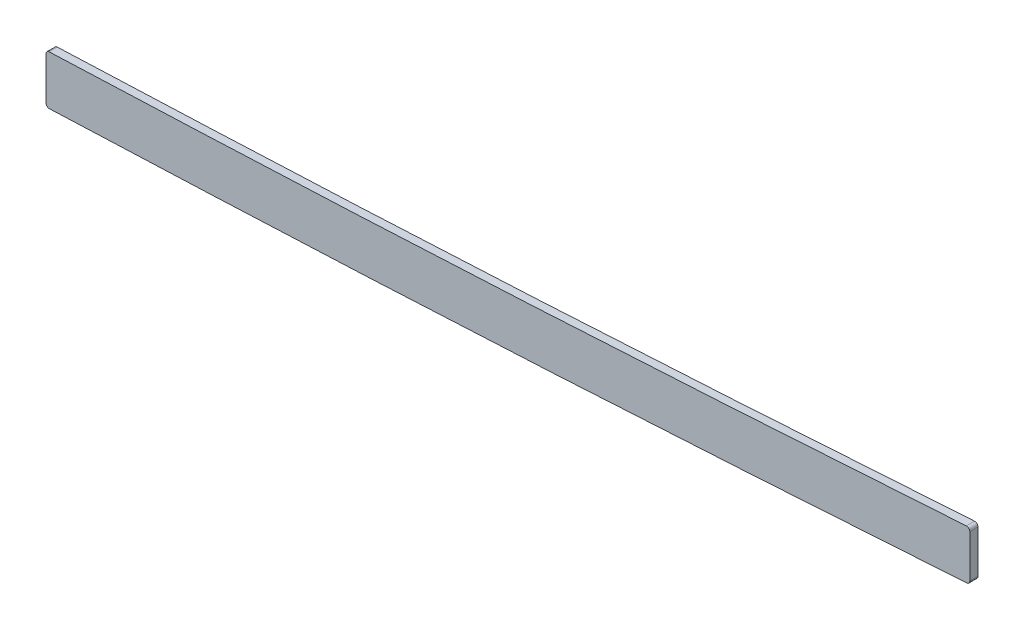
ISO-10303-21;
HEADER;
FILE_DESCRIPTION(('STEP AP214'),'2;1');
FILE_NAME('part.step','',(''),(''),'','','');
FILE_SCHEMA(('AUTOMOTIVE_DESIGN { 1 0 10303 214 1 1 1 1 }'));
ENDSEC;
DATA;
#1=APPLICATION_CONTEXT('core data for automotive mechanical design processes');
#2=APPLICATION_PROTOCOL_DEFINITION('international standard','automotive_design',2000,#1);
#3=PRODUCT_CONTEXT('',#1,'mechanical');
#4=PRODUCT('Part','Part','',(#3));
#5=PRODUCT_RELATED_PRODUCT_CATEGORY('part','',(#4));
#6=PRODUCT_DEFINITION_FORMATION('','',#4);
#7=PRODUCT_DEFINITION_CONTEXT('part definition',#1,'design');
#8=PRODUCT_DEFINITION('design','',#6,#7);
#9=PRODUCT_DEFINITION_SHAPE('','',#8);
#10=(LENGTH_UNIT() NAMED_UNIT(*) SI_UNIT(.MILLI.,.METRE.));
#11=(NAMED_UNIT(*) PLANE_ANGLE_UNIT() SI_UNIT($,.RADIAN.));
#12=(NAMED_UNIT(*) SI_UNIT($,.STERADIAN.) SOLID_ANGLE_UNIT());
#13=UNCERTAINTY_MEASURE_WITH_UNIT(LENGTH_MEASURE(1.E-05),#10,'distance_accuracy_value','');
#14=(GEOMETRIC_REPRESENTATION_CONTEXT(3) GLOBAL_UNCERTAINTY_ASSIGNED_CONTEXT((#13)) GLOBAL_UNIT_ASSIGNED_CONTEXT((#10,
#11,#12)) REPRESENTATION_CONTEXT('',''));
#15=CARTESIAN_POINT('',(0.,0.,0.));
#16=DIRECTION('',(0.,0.,1.));
#17=DIRECTION('',(1.,0.,0.));
#18=AXIS2_PLACEMENT_3D('',#15,#16,#17);
#19=CARTESIAN_POINT('',(2669.54,6.20943054630084E-11,1.5875));
#20=DIRECTION('',(1.,0.,0.));
#21=DIRECTION('',(0.,1.,0.));
#22=AXIS2_PLACEMENT_3D('',#19,#20,#21);
#23=PLANE('',#22);
#24=DIRECTION('',(0.,-1.,0.));
#25=VECTOR('',#24,1.);
#26=CARTESIAN_POINT('',(2669.54,6.20943054630084E-11,-1.5875));
#27=LINE('',#26,#25);
#28=CARTESIAN_POINT('',(2669.54,8.16576508272443,-1.5875));
#29=VERTEX_POINT('',#28);
#30=CARTESIAN_POINT('',(2669.54,-8.38067282995173,-1.5875));
#31=VERTEX_POINT('',#30);
#32=EDGE_CURVE('E144',#29,#31,#27,.T.);
#33=ORIENTED_EDGE('',*,*,#32,.F.);
#34=DIRECTION('',(0.,0.,1.));
#35=VECTOR('',#34,1.);
#36=CARTESIAN_POINT('',(2669.54,8.16576508272443,1.5875));
#37=LINE('',#36,#35);
#38=CARTESIAN_POINT('',(2669.54,8.16576508272443,1.5875));
#39=VERTEX_POINT('',#38);
#40=EDGE_CURVE('E118',#29,#39,#37,.T.);
#41=ORIENTED_EDGE('',*,*,#40,.T.);
#42=DIRECTION('',(0.,-1.,0.));
#43=VECTOR('',#42,1.);
#44=CARTESIAN_POINT('',(2669.54,6.20943054630084E-11,1.5875));
#45=LINE('',#44,#43);
#46=CARTESIAN_POINT('',(2669.54,-8.38067282995173,1.5875));
#47=VERTEX_POINT('',#46);
#48=EDGE_CURVE('E223',#39,#47,#45,.T.);
#49=ORIENTED_EDGE('',*,*,#48,.T.);
#50=DIRECTION('',(0.,0.,-1.));
#51=VECTOR('',#50,1.);
#52=CARTESIAN_POINT('',(2669.54,-8.38067282995173,1.5875));
#53=LINE('',#52,#51);
#54=EDGE_CURVE('E124',#47,#31,#53,.T.);
#55=ORIENTED_EDGE('',*,*,#54,.T.);
#56=EDGE_LOOP('',(#33,#41,#49,#55));
#57=FACE_BOUND('',#56,.T.);
#58=ADVANCED_FACE('F45',(#57),#23,.T.);
#59=CARTESIAN_POINT('',(2698.48667469404,11.4806601503293,1.5875));
#60=CARTESIAN_POINT('',(2691.24737670604,10.9833200828121,1.5875));
#61=CARTESIAN_POINT('',(2679.19516047804,10.1655376868452,1.5875));
#62=CARTESIAN_POINT('',(2662.27652557768,9.03876140898899,1.5875));
#63=CARTESIAN_POINT('',(2635.66628230206,7.2924691456857,1.5875));
#64=CARTESIAN_POINT('',(2596.85766552893,4.8260568530791,1.5875));
#65=CARTESIAN_POINT('',(2545.72974303923,1.75834409257586,1.5875));
#66=CARTESIAN_POINT('',(2494.40530570724,-1.09855523520035,1.5875));
#67=CARTESIAN_POINT('',(2451.53302226734,-3.26657329681936,1.5875));
#68=CARTESIAN_POINT('',(2417.1983167563,-4.86708361008882,1.5875));
#69=CARTESIAN_POINT('',(2391.45707691927,-6.00358923536048,1.5875));
#70=CARTESIAN_POINT('',(2365.63473630713,-7.08685458139135,1.5875));
#71=CARTESIAN_POINT('',(2341.01564201859,-8.07854239792197,1.5875));
#72=CARTESIAN_POINT('',(2320.75075371474,-8.87838665592377,1.5875));
#73=CARTESIAN_POINT('',(2303.44750893366,-9.5580697754435,1.5875));
#74=CARTESIAN_POINT('',(2284.76007664293,-10.2922011195427,1.5875));
#75=CARTESIAN_POINT('',(2261.7633474368,-11.2010322967668,1.5875));
#76=CARTESIAN_POINT('',(2227.28532971514,-12.5838425566113,1.5875));
#77=CARTESIAN_POINT('',(2184.17556939327,-14.3660723604172,1.5875));
#78=CARTESIAN_POINT('',(2132.42906611447,-16.6074278682384,1.5875));
#79=CARTESIAN_POINT('',(2063.42552339989,-19.708920484548,1.5875));
#80=CARTESIAN_POINT('',(1977.17490763451,-23.7005433130483,1.5875));
#81=CARTESIAN_POINT('',(1873.73245143151,-28.149389220677,1.5875));
#82=CARTESIAN_POINT('',(1770.37461881016,-31.6574686487852,1.5875));
#83=CARTESIAN_POINT('',(1667.08568781321,-33.7931175563218,1.5875));
#84=CARTESIAN_POINT('',(1581.01109449057,-34.3831888311612,1.5875));
#85=CARTESIAN_POINT('',(1512.07397125959,-34.4278026003723,1.5875));
#86=CARTESIAN_POINT('',(1443.06151347714,-34.4095104024296,1.5875));
#87=CARTESIAN_POINT('',(1356.80092787913,-34.4244328117572,1.5875));
#88=CARTESIAN_POINT('',(1218.79462695393,-34.4184647879491,1.5875));
#89=CARTESIAN_POINT('',(1115.28902278569,-34.4207027968771,1.5875));
#90=CARTESIAN_POINT('',(1046.28548189005,-34.4207027968771,1.5875));
#91=B_SPLINE_CURVE_WITH_KNOTS('',3,(#59,#60,#61,#62,#63,#64,#65,#66,#67,#68,#69,#70,#71,#72,#73,
#74,#75,#76,#77,#78,#79,#80,#81,#82,#83,#84,#85,#86,#87,#88,#89,#90),.UNSPECIFIED.,.F.,.F.,(4,1,
1,1,1,1,1,1,1,1,1,1,1,1,1,1,1,1,1,1,1,1,1,1,1,1,1,1,1,4),(100.654804519159,102.842388131745,
104.300777206802,105.766098402935,110.877392286712,115.988686170488,121.099980054264,
126.21127393804,128.766920879929,131.322567821817,133.878214763705,136.433861705593,
138.557690156206,139.83551362715,141.545155589369,144.100802531257,146.656449473146,
151.767743356922,156.879037240698,161.990331124474,172.212918892027,182.43550665958,
192.658094427132,202.880682194685,213.103269962237,218.214563846014,223.32585772979,
233.548445497342,243.771033264895,264.2162088),.UNSPECIFIED.);
#92=DIRECTION('',(0.,0.,-1.));
#93=VECTOR('',#92,1.);
#94=SURFACE_OF_LINEAR_EXTRUSION('',#91,#93);
#95=CARTESIAN_POINT('',(2668.1857171688,9.4329653054066,1.5875));
#96=VERTEX_POINT('',#95);
#97=CARTESIAN_POINT('',(2312.62011977482,-9.19769933440686,1.5875));
#98=VERTEX_POINT('',#97);
#99=EDGE_CURVE('E134',#96,#98,#91,.T.);
#100=ORIENTED_EDGE('',*,*,#99,.F.);
#101=DIRECTION('',(0.,0.,-1.));
#102=VECTOR('',#101,1.);
#103=CARTESIAN_POINT('',(2668.18571716881,9.43296530540671,1.5875));
#104=LINE('',#103,#102);
#105=CARTESIAN_POINT('',(2668.18571716881,9.43296530540666,-1.5875));
#106=VERTEX_POINT('',#105);
#107=EDGE_CURVE('E117',#96,#106,#104,.T.);
#108=ORIENTED_EDGE('',*,*,#107,.T.);
#109=CARTESIAN_POINT('',(2698.48667469404,11.4806601503293,-1.5875));
#110=CARTESIAN_POINT('',(2691.24737670604,10.9833200828121,-1.5875));
#111=CARTESIAN_POINT('',(2679.19516047804,10.1655376868452,-1.5875));
#112=CARTESIAN_POINT('',(2662.27652557768,9.03876140898899,-1.5875));
#113=CARTESIAN_POINT('',(2635.66628230206,7.2924691456857,-1.5875));
#114=CARTESIAN_POINT('',(2596.85766552893,4.8260568530791,-1.5875));
#115=CARTESIAN_POINT('',(2545.72974303923,1.75834409257586,-1.5875));
#116=CARTESIAN_POINT('',(2494.40530570724,-1.09855523520035,-1.5875));
#117=CARTESIAN_POINT('',(2451.53302226734,-3.26657329681936,-1.5875));
#118=CARTESIAN_POINT('',(2417.1983167563,-4.86708361008882,-1.5875));
#119=CARTESIAN_POINT('',(2391.45707691927,-6.00358923536048,-1.5875));
#120=CARTESIAN_POINT('',(2365.63473630713,-7.08685458139135,-1.5875));
#121=CARTESIAN_POINT('',(2341.01564201859,-8.07854239792197,-1.5875));
#122=CARTESIAN_POINT('',(2320.75075371474,-8.87838665592377,-1.5875));
#123=CARTESIAN_POINT('',(2303.44750893366,-9.5580697754435,-1.5875));
#124=CARTESIAN_POINT('',(2284.76007664293,-10.2922011195427,-1.5875));
#125=CARTESIAN_POINT('',(2261.7633474368,-11.2010322967668,-1.5875));
#126=CARTESIAN_POINT('',(2227.28532971514,-12.5838425566113,-1.5875));
#127=CARTESIAN_POINT('',(2184.17556939327,-14.3660723604172,-1.5875));
#128=CARTESIAN_POINT('',(2132.42906611447,-16.6074278682384,-1.5875));
#129=CARTESIAN_POINT('',(2063.42552339989,-19.708920484548,-1.5875));
#130=CARTESIAN_POINT('',(1977.17490763451,-23.7005433130483,-1.5875));
#131=CARTESIAN_POINT('',(1873.73245143151,-28.149389220677,-1.5875));
#132=CARTESIAN_POINT('',(1770.37461881016,-31.6574686487852,-1.5875));
#133=CARTESIAN_POINT('',(1667.08568781321,-33.7931175563218,-1.5875));
#134=CARTESIAN_POINT('',(1581.01109449057,-34.3831888311612,-1.5875));
#135=CARTESIAN_POINT('',(1512.07397125959,-34.4278026003723,-1.5875));
#136=CARTESIAN_POINT('',(1443.06151347714,-34.4095104024296,-1.5875));
#137=CARTESIAN_POINT('',(1356.80092787913,-34.4244328117572,-1.5875));
#138=CARTESIAN_POINT('',(1218.79462695393,-34.4184647879491,-1.5875));
#139=CARTESIAN_POINT('',(1115.28902278569,-34.4207027968771,-1.5875));
#140=CARTESIAN_POINT('',(1046.28548189005,-34.4207027968771,-1.5875));
#141=B_SPLINE_CURVE_WITH_KNOTS('',3,(#109,#110,#111,#112,#113,#114,#115,#116,#117,#118,#119,
#120,#121,#122,#123,#124,#125,#126,#127,#128,#129,#130,#131,#132,#133,#134,#135,#136,#137,#138,
#139,#140),.UNSPECIFIED.,.F.,.F.,(4,1,1,1,1,1,1,1,1,1,1,1,1,1,1,1,1,1,1,1,1,1,1,1,1,1,1,1,1,4),
(100.654804519159,102.842388131745,104.300777206802,105.766098402935,110.877392286712,
115.988686170488,121.099980054264,126.21127393804,128.766920879929,131.322567821817,
133.878214763705,136.433861705593,138.557690156206,139.83551362715,141.545155589369,
144.100802531257,146.656449473146,151.767743356922,156.879037240698,161.990331124474,
172.212918892027,182.43550665958,192.658094427132,202.880682194685,213.103269962237,
218.214563846014,223.32585772979,233.548445497342,243.771033264895,264.2162088),.UNSPECIFIED.);
#142=CARTESIAN_POINT('',(2312.62011977482,-9.19769933440686,-1.5875));
#143=VERTEX_POINT('',#142);
#144=EDGE_CURVE('E131',#106,#143,#141,.T.);
#145=ORIENTED_EDGE('',*,*,#144,.T.);
#146=DIRECTION('',(0.,0.,-1.));
#147=VECTOR('',#146,1.);
#148=CARTESIAN_POINT('',(2312.62011977482,-9.19769933440686,-1.5875));
#149=LINE('',#148,#147);
#150=EDGE_CURVE('E137',#143,#98,#149,.F.);
#151=ORIENTED_EDGE('',*,*,#150,.T.);
#152=EDGE_LOOP('',(#100,#108,#145,#151));
#153=FACE_BOUND('',#152,.T.);
#154=ADVANCED_FACE('F130',(#153),#94,.F.);
#155=CARTESIAN_POINT('',(2311.4,5.38412677974243E-11,1.5875));
#156=DIRECTION('',(1.,0.,0.));
#157=DIRECTION('',(0.,1.,0.));
#158=AXIS2_PLACEMENT_3D('',#155,#156,#157);
#159=PLANE('',#158);
#160=DIRECTION('',(0.,-1.,0.));
#161=VECTOR('',#160,1.);
#162=CARTESIAN_POINT('',(2311.4,5.38412677974243E-11,1.5875));
#163=LINE('',#162,#161);
#164=CARTESIAN_POINT('',(2311.4,-10.4667194142858,1.5875));
#165=VERTEX_POINT('',#164);
#166=CARTESIAN_POINT('',(2311.4,-26.989466917101,1.5875));
#167=VERTEX_POINT('',#166);
#168=EDGE_CURVE('E215',#165,#167,#163,.T.);
#169=ORIENTED_EDGE('',*,*,#168,.F.);
#170=DIRECTION('',(0.,0.,-1.));
#171=VECTOR('',#170,1.);
#172=CARTESIAN_POINT('',(2311.4,-10.4667194142858,1.5875));
#173=LINE('',#172,#171);
#174=CARTESIAN_POINT('',(2311.4,-10.4667194142858,-1.5875));
#175=VERTEX_POINT('',#174);
#176=EDGE_CURVE('E11',#165,#175,#173,.T.);
#177=ORIENTED_EDGE('',*,*,#176,.T.);
#178=DIRECTION('',(0.,-1.,0.));
#179=VECTOR('',#178,1.);
#180=CARTESIAN_POINT('',(2311.4,5.38412677974243E-11,-1.5875));
#181=LINE('',#180,#179);
#182=CARTESIAN_POINT('',(2311.4,-26.989466917101,-1.5875));
#183=VERTEX_POINT('',#182);
#184=EDGE_CURVE('E143',#175,#183,#181,.T.);
#185=ORIENTED_EDGE('',*,*,#184,.T.);
#186=DIRECTION('',(0.,0.,1.));
#187=VECTOR('',#186,1.);
#188=CARTESIAN_POINT('',(2311.4,-26.989466917101,1.5875));
#189=LINE('',#188,#187);
#190=EDGE_CURVE('E54',#183,#167,#189,.T.);
#191=ORIENTED_EDGE('',*,*,#190,.T.);
#192=EDGE_LOOP('',(#169,#177,#185,#191));
#193=FACE_BOUND('',#192,.T.);
#194=ADVANCED_FACE('F184',(#193),#159,.F.);
#195=CARTESIAN_POINT('',(2699.79233294449,-7.52454325644929,1.5875));
#196=CARTESIAN_POINT('',(2639.63682069028,-11.6572294058032,1.5875));
#197=CARTESIAN_POINT('',(2579.48130742255,-15.435846921513,1.5875));
#198=CARTESIAN_POINT('',(2518.49810546626,-19.1485286488731,1.5875));
#199=CARTESIAN_POINT('',(2436.3555443117,-23.2523639114786,1.5875));
#200=CARTESIAN_POINT('',(2354.21298315715,-26.6314864233564,1.5875));
#201=CARTESIAN_POINT('',(2332.5703304682,-27.4809881692809,1.5875));
#202=CARTESIAN_POINT('',(2156.26863942885,-34.3777685431634,1.5875));
#203=CARTESIAN_POINT('',(1979.96694737597,-41.6286312484567,1.5875));
#204=CARTESIAN_POINT('',(1824.11427763497,-52.7712658766203,1.5875));
#205=CARTESIAN_POINT('',(1636.92860677809,-53.5795698486924,1.5875));
#206=CARTESIAN_POINT('',(1449.7429359212,-53.4540246131279,1.5875));
#207=CARTESIAN_POINT('',(1418.00673093479,-53.4707027968771,1.5875));
#208=CARTESIAN_POINT('',(1324.89933614602,-53.4707027968771,1.5875));
#209=CARTESIAN_POINT('',(1231.79194034372,-53.4707027968771,1.5875));
#210=CARTESIAN_POINT('',(1170.4412693194,-53.4707027968771,1.5875));
#211=CARTESIAN_POINT('',(1108.78407581299,-53.4707027968771,1.5875));
#212=CARTESIAN_POINT('',(1047.12688234629,-53.4707027968771,1.5875));
#213=CARTESIAN_POINT('',(1046.84641418849,-53.4707027968771,1.5875));
#214=CARTESIAN_POINT('',(1046.56594718406,-53.4707027968771,1.5875));
#215=CARTESIAN_POINT('',(1046.28548189005,-53.4707027968771,1.5875));
#216=(BOUNDED_CURVE() B_SPLINE_CURVE(5,(#195,#196,#197,#198,#199,#200,#201,#202,#203,#204,#205,
#206,#207,#208,#209,#210,#211,#212,#213,#214,#215),.UNSPECIFIED.,.F.,
.F.) B_SPLINE_CURVE_WITH_KNOTS((6,3,3,3,3,3,6),(100.654804519159,130.927896619159,
141.337054719159,218.101815019159,233.772059419159,264.077723219159,264.2162088),
.UNSPECIFIED.) CURVE() GEOMETRIC_REPRESENTATION_ITEM() RATIONAL_B_SPLINE_CURVE((1.,1.,1.,1.,1.,
1.,1.,1.,1.,1.,1.,1.,1.,1.,1.,1.,1.,1.,1.,1.,1.)) REPRESENTATION_ITEM(''));
#217=DIRECTION('',(0.,0.,-1.));
#218=VECTOR('',#217,1.);
#219=SURFACE_OF_LINEAR_EXTRUSION('',#216,#218);
#220=CARTESIAN_POINT('',(2312.71987514369,-28.2584871967033,-1.5875));
#221=CARTESIAN_POINT('',(2329.40547783021,-27.6027081900987,-1.5875));
#222=CARTESIAN_POINT('',(2346.19503632831,-26.9408313965916,-1.5875));
#223=CARTESIAN_POINT('',(2363.08398911934,-26.2644441857733,-1.5875));
#224=CARTESIAN_POINT('',(2434.40380877238,-23.2965631449422,-1.5875));
#225=CARTESIAN_POINT('',(2505.72362842541,-19.7823585871208,-1.5875));
#226=CARTESIAN_POINT('',(2560.35960699296,-16.5784214349998,-1.5875));
#227=CARTESIAN_POINT('',(2614.44199917946,-13.229682637772,-1.5875));
#228=CARTESIAN_POINT('',(2668.35419031106,-9.64787920285397,-1.5875));
#229=(BOUNDED_CURVE() B_SPLINE_CURVE(5,(#220,#221,#222,#223,#224,#225,#226,#227,#228),
.UNSPECIFIED.,.F.,.F.) B_SPLINE_CURVE_WITH_KNOTS((6,3,6),(103.818173568317,112.030586893093,
139.140309943934),
.UNSPECIFIED.) CURVE() GEOMETRIC_REPRESENTATION_ITEM() RATIONAL_B_SPLINE_CURVE((1.,1.,1.,1.,1.,
1.,1.,1.,1.)) REPRESENTATION_ITEM(''));
#230=CARTESIAN_POINT('',(2668.35419046547,-9.64788152706516,-1.5875));
#231=VERTEX_POINT('',#230);
#232=CARTESIAN_POINT('',(2312.71987502721,-28.2584842330797,-1.5875));
#233=VERTEX_POINT('',#232);
#234=EDGE_CURVE('E150',#231,#233,#229,.F.);
#235=ORIENTED_EDGE('',*,*,#234,.F.);
#236=DIRECTION('',(0.,0.,-1.));
#237=VECTOR('',#236,1.);
#238=CARTESIAN_POINT('',(2668.35419031102,-9.64787920285633,-1.5875));
#239=LINE('',#238,#237);
#240=CARTESIAN_POINT('',(2668.35419046551,-9.64788152744234,1.5875));
#241=VERTEX_POINT('',#240);
#242=EDGE_CURVE('E68',#231,#241,#239,.F.);
#243=ORIENTED_EDGE('',*,*,#242,.T.);
#244=CARTESIAN_POINT('',(2668.35419031106,-9.64787920285402,1.5875));
#245=CARTESIAN_POINT('',(2614.44199917946,-13.229682637772,1.5875));
#246=CARTESIAN_POINT('',(2560.35960699296,-16.5784214349999,1.5875));
#247=CARTESIAN_POINT('',(2505.72362842541,-19.7823585871209,1.5875));
#248=CARTESIAN_POINT('',(2434.40380877238,-23.2965631449419,1.5875));
#249=CARTESIAN_POINT('',(2363.08398911935,-26.2644441857729,1.5875));
#250=CARTESIAN_POINT('',(2346.19503632833,-26.9408313965909,1.5875));
#251=CARTESIAN_POINT('',(2329.40547783023,-27.6027081900979,1.5875));
#252=CARTESIAN_POINT('',(2312.71987514372,-28.2584871967023,1.5875));
#253=(BOUNDED_CURVE() B_SPLINE_CURVE(5,(#244,#245,#246,#247,#248,#249,#250,#251,#252),
.UNSPECIFIED.,.F.,.F.) B_SPLINE_CURVE_WITH_KNOTS((6,3,6),(103.818173568318,130.927896619159,
139.140309943932),
.UNSPECIFIED.) CURVE() GEOMETRIC_REPRESENTATION_ITEM() RATIONAL_B_SPLINE_CURVE((1.,1.,1.,1.,1.,
1.,1.,1.,1.)) REPRESENTATION_ITEM(''));
#254=CARTESIAN_POINT('',(2312.7198750272,-28.2584842327322,1.5875));
#255=VERTEX_POINT('',#254);
#256=EDGE_CURVE('E212',#241,#255,#253,.T.);
#257=ORIENTED_EDGE('',*,*,#256,.T.);
#258=DIRECTION('',(0.,0.,-1.));
#259=VECTOR('',#258,1.);
#260=CARTESIAN_POINT('',(2312.71987514529,-28.2584871966404,1.5875));
#261=LINE('',#260,#259);
#262=EDGE_CURVE('E258',#255,#233,#261,.T.);
#263=ORIENTED_EDGE('',*,*,#262,.T.);
#264=EDGE_LOOP('',(#235,#243,#257,#263));
#265=FACE_BOUND('',#264,.T.);
#266=ADVANCED_FACE('F173',(#265),#219,.T.);
#267=CARTESIAN_POINT('',(0.,0.,1.5875));
#268=DIRECTION('',(0.,0.,1.));
#269=DIRECTION('',(1.,0.,0.));
#270=AXIS2_PLACEMENT_3D('',#267,#268,#269);
#271=PLANE('',#270);
#272=ORIENTED_EDGE('',*,*,#48,.F.);
#273=CARTESIAN_POINT('',(2668.27,8.1657650827244,1.5875));
#274=DIRECTION('',(0.,0.,1.));
#275=DIRECTION('',(1.,0.,0.));
#276=AXIS2_PLACEMENT_3D('',#273,#274,#275);
#277=CIRCLE('',#276,1.27);
#278=EDGE_CURVE('E253',#39,#96,#277,.T.);
#279=ORIENTED_EDGE('',*,*,#278,.T.);
#280=ORIENTED_EDGE('',*,*,#99,.T.);
#281=CARTESIAN_POINT('',(2312.67,-10.4667194142858,1.5875));
#282=DIRECTION('',(0.,0.,1.));
#283=DIRECTION('',(1.,0.,0.));
#284=AXIS2_PLACEMENT_3D('',#281,#282,#283);
#285=CIRCLE('',#284,1.27);
#286=EDGE_CURVE('E242',#98,#165,#285,.T.);
#287=ORIENTED_EDGE('',*,*,#286,.T.);
#288=ORIENTED_EDGE('',*,*,#168,.T.);
#289=CARTESIAN_POINT('',(2312.67,-26.989466917101,1.5875));
#290=DIRECTION('',(0.,0.,1.));
#291=DIRECTION('',(1.,0.,0.));
#292=AXIS2_PLACEMENT_3D('',#289,#290,#291);
#293=CIRCLE('',#292,1.27);
#294=EDGE_CURVE('E61',#167,#255,#293,.T.);
#295=ORIENTED_EDGE('',*,*,#294,.T.);
#296=ORIENTED_EDGE('',*,*,#256,.F.);
#297=CARTESIAN_POINT('',(2668.27,-8.38067282995176,1.5875));
#298=DIRECTION('',(0.,0.,1.));
#299=DIRECTION('',(1.,0.,0.));
#300=AXIS2_PLACEMENT_3D('',#297,#298,#299);
#301=CIRCLE('',#300,1.27);
#302=EDGE_CURVE('E246',#241,#47,#301,.T.);
#303=ORIENTED_EDGE('',*,*,#302,.T.);
#304=EDGE_LOOP('',(#272,#279,#280,#287,#288,#295,#296,#303));
#305=FACE_BOUND('',#304,.T.);
#306=ADVANCED_FACE('F183',(#305),#271,.T.);
#307=CARTESIAN_POINT('',(0.,0.,-1.5875));
#308=DIRECTION('',(0.,0.,1.));
#309=DIRECTION('',(1.,0.,0.));
#310=AXIS2_PLACEMENT_3D('',#307,#308,#309);
#311=PLANE('',#310);
#312=ORIENTED_EDGE('',*,*,#144,.F.);
#313=CARTESIAN_POINT('',(2668.27,8.1657650827244,-1.5875));
#314=DIRECTION('',(0.,0.,1.));
#315=DIRECTION('',(1.,0.,0.));
#316=AXIS2_PLACEMENT_3D('',#313,#314,#315);
#317=CIRCLE('',#316,1.27);
#318=EDGE_CURVE('E113',#106,#29,#317,.F.);
#319=ORIENTED_EDGE('',*,*,#318,.T.);
#320=ORIENTED_EDGE('',*,*,#32,.T.);
#321=CARTESIAN_POINT('',(2668.27,-8.38067282995176,-1.5875));
#322=DIRECTION('',(0.,0.,1.));
#323=DIRECTION('',(1.,0.,0.));
#324=AXIS2_PLACEMENT_3D('',#321,#322,#323);
#325=CIRCLE('',#324,1.27);
#326=EDGE_CURVE('E125',#31,#231,#325,.F.);
#327=ORIENTED_EDGE('',*,*,#326,.T.);
#328=ORIENTED_EDGE('',*,*,#234,.T.);
#329=CARTESIAN_POINT('',(2312.67,-26.989466917101,-1.5875));
#330=DIRECTION('',(0.,0.,1.));
#331=DIRECTION('',(1.,0.,0.));
#332=AXIS2_PLACEMENT_3D('',#329,#330,#331);
#333=CIRCLE('',#332,1.27);
#334=EDGE_CURVE('E136',#233,#183,#333,.F.);
#335=ORIENTED_EDGE('',*,*,#334,.T.);
#336=ORIENTED_EDGE('',*,*,#184,.F.);
#337=CARTESIAN_POINT('',(2312.67,-10.4667194142858,-1.5875));
#338=DIRECTION('',(0.,0.,1.));
#339=DIRECTION('',(1.,0.,0.));
#340=AXIS2_PLACEMENT_3D('',#337,#338,#339);
#341=CIRCLE('',#340,1.27);
#342=EDGE_CURVE('E141',#175,#143,#341,.F.);
#343=ORIENTED_EDGE('',*,*,#342,.T.);
#344=EDGE_LOOP('',(#312,#319,#320,#327,#328,#335,#336,#343));
#345=FACE_BOUND('',#344,.T.);
#346=ADVANCED_FACE('F139',(#345),#311,.F.);
#347=CARTESIAN_POINT('',(2668.27,8.1657650827244,0.));
#348=DIRECTION('',(0.,0.,-1.));
#349=DIRECTION('',(-1.,0.,0.));
#350=AXIS2_PLACEMENT_3D('',#347,#348,#349);
#351=CYLINDRICAL_SURFACE('',#350,1.27);
#352=ORIENTED_EDGE('',*,*,#278,.F.);
#353=ORIENTED_EDGE('',*,*,#40,.F.);
#354=ORIENTED_EDGE('',*,*,#318,.F.);
#355=ORIENTED_EDGE('',*,*,#107,.F.);
#356=EDGE_LOOP('',(#352,#353,#354,#355));
#357=FACE_BOUND('',#356,.T.);
#358=ADVANCED_FACE('F116',(#357),#351,.T.);
#359=CARTESIAN_POINT('',(2668.27,-8.38067282995176,0.));
#360=DIRECTION('',(0.,0.,-1.));
#361=DIRECTION('',(-1.,0.,0.));
#362=AXIS2_PLACEMENT_3D('',#359,#360,#361);
#363=CYLINDRICAL_SURFACE('',#362,1.27);
#364=ORIENTED_EDGE('',*,*,#302,.F.);
#365=ORIENTED_EDGE('',*,*,#242,.F.);
#366=ORIENTED_EDGE('',*,*,#326,.F.);
#367=ORIENTED_EDGE('',*,*,#54,.F.);
#368=EDGE_LOOP('',(#364,#365,#366,#367));
#369=FACE_BOUND('',#368,.T.);
#370=ADVANCED_FACE('F291',(#369),#363,.T.);
#371=CARTESIAN_POINT('',(2312.67,-10.4667194142858,0.));
#372=DIRECTION('',(0.,0.,-1.));
#373=DIRECTION('',(-1.,0.,0.));
#374=AXIS2_PLACEMENT_3D('',#371,#372,#373);
#375=CYLINDRICAL_SURFACE('',#374,1.27);
#376=ORIENTED_EDGE('',*,*,#286,.F.);
#377=ORIENTED_EDGE('',*,*,#150,.F.);
#378=ORIENTED_EDGE('',*,*,#342,.F.);
#379=ORIENTED_EDGE('',*,*,#176,.F.);
#380=EDGE_LOOP('',(#376,#377,#378,#379));
#381=FACE_BOUND('',#380,.T.);
#382=ADVANCED_FACE('F301',(#381),#375,.T.);
#383=CARTESIAN_POINT('',(2312.67,-26.989466917101,0.));
#384=DIRECTION('',(0.,0.,-1.));
#385=DIRECTION('',(-1.,0.,0.));
#386=AXIS2_PLACEMENT_3D('',#383,#384,#385);
#387=CYLINDRICAL_SURFACE('',#386,1.27);
#388=ORIENTED_EDGE('',*,*,#294,.F.);
#389=ORIENTED_EDGE('',*,*,#190,.F.);
#390=ORIENTED_EDGE('',*,*,#334,.F.);
#391=ORIENTED_EDGE('',*,*,#262,.F.);
#392=EDGE_LOOP('',(#388,#389,#390,#391));
#393=FACE_BOUND('',#392,.T.);
#394=ADVANCED_FACE('F47',(#393),#387,.T.);
#395=CLOSED_SHELL('',(#58,#154,#194,#266,#306,#346,#358,#370,#382,#394));
#396=MANIFOLD_SOLID_BREP('B2',#395);
#397=ADVANCED_BREP_SHAPE_REPRESENTATION('',(#18,#396),#14);
#398=SHAPE_DEFINITION_REPRESENTATION(#9,#397);
ENDSEC;
END-ISO-10303-21;
